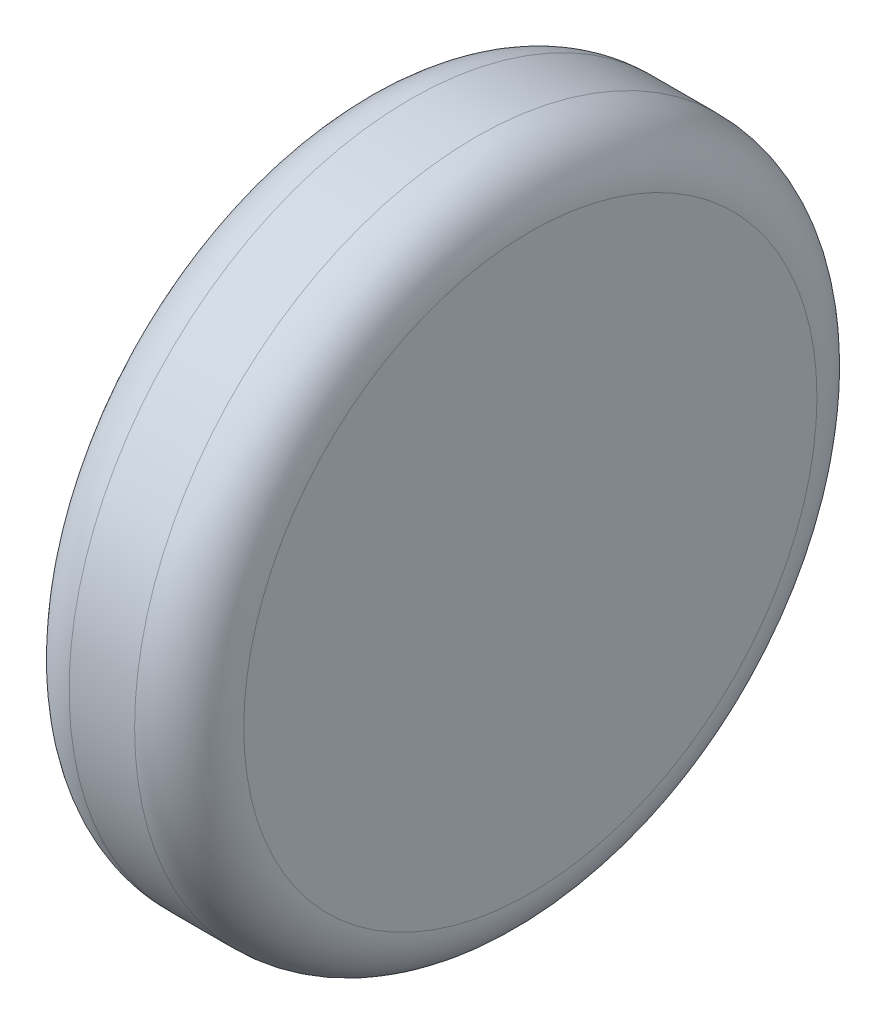
ISO-10303-21;
HEADER;
FILE_DESCRIPTION(('STEP AP214'),'2;1');
FILE_NAME('part.step','',(''),(''),'','','');
FILE_SCHEMA(('AUTOMOTIVE_DESIGN { 1 0 10303 214 1 1 1 1 }'));
ENDSEC;
DATA;
#1=APPLICATION_CONTEXT('core data for automotive mechanical design processes');
#2=APPLICATION_PROTOCOL_DEFINITION('international standard','automotive_design',2000,#1);
#3=PRODUCT_CONTEXT('',#1,'mechanical');
#4=PRODUCT('Part','Part','',(#3));
#5=PRODUCT_RELATED_PRODUCT_CATEGORY('part','',(#4));
#6=PRODUCT_DEFINITION_FORMATION('','',#4);
#7=PRODUCT_DEFINITION_CONTEXT('part definition',#1,'design');
#8=PRODUCT_DEFINITION('design','',#6,#7);
#9=PRODUCT_DEFINITION_SHAPE('','',#8);
#10=(LENGTH_UNIT() NAMED_UNIT(*) SI_UNIT(.MILLI.,.METRE.));
#11=(NAMED_UNIT(*) PLANE_ANGLE_UNIT() SI_UNIT($,.RADIAN.));
#12=(NAMED_UNIT(*) SI_UNIT($,.STERADIAN.) SOLID_ANGLE_UNIT());
#13=UNCERTAINTY_MEASURE_WITH_UNIT(LENGTH_MEASURE(1.E-05),#10,'distance_accuracy_value','');
#14=(GEOMETRIC_REPRESENTATION_CONTEXT(3) GLOBAL_UNCERTAINTY_ASSIGNED_CONTEXT((#13)) GLOBAL_UNIT_ASSIGNED_CONTEXT((#10,
#11,#12)) REPRESENTATION_CONTEXT('',''));
#15=CARTESIAN_POINT('',(0.,0.,0.));
#16=DIRECTION('',(0.,0.,1.));
#17=DIRECTION('',(1.,0.,0.));
#18=AXIS2_PLACEMENT_3D('',#15,#16,#17);
#19=CARTESIAN_POINT('',(-0.390364285309383,-0.332340218761648,0.1012));
#20=DIRECTION('',(1.,0.,0.));
#21=DIRECTION('',(0.,1.,0.));
#22=AXIS2_PLACEMENT_3D('',#19,#20,#21);
#23=PLANE('',#22);
#24=CARTESIAN_POINT('',(-0.390364285309383,-0.332340218761648,0.1012));
#25=DIRECTION('',(1.,0.,0.));
#26=DIRECTION('',(0.,0.,-1.));
#27=AXIS2_PLACEMENT_3D('',#24,#25,#26);
#28=CIRCLE('',#27,0.0262499999999999);
#29=CARTESIAN_POINT('',(-0.390364285309383,-0.332340218761648,0.0749500000000001));
#30=VERTEX_POINT('',#29);
#31=CARTESIAN_POINT('',(-0.390364285309383,-0.306090218761648,0.1012));
#32=VERTEX_POINT('',#31);
#33=EDGE_CURVE('E55',#30,#32,#28,.T.);
#34=ORIENTED_EDGE('',*,*,#33,.F.);
#35=CARTESIAN_POINT('',(-0.390364285309383,-0.332340218761648,0.1012));
#36=DIRECTION('',(1.,0.,0.));
#37=DIRECTION('',(0.,0.,1.));
#38=AXIS2_PLACEMENT_3D('',#35,#36,#37);
#39=CIRCLE('',#38,0.02625);
#40=CARTESIAN_POINT('',(-0.390364285309383,-0.332340218761648,0.12745));
#41=VERTEX_POINT('',#40);
#42=EDGE_CURVE('E49',#41,#30,#39,.T.);
#43=ORIENTED_EDGE('',*,*,#42,.F.);
#44=CARTESIAN_POINT('',(-0.390364285309383,-0.332340218761648,0.1012));
#45=DIRECTION('',(1.,0.,0.));
#46=DIRECTION('',(0.,1.,0.));
#47=AXIS2_PLACEMENT_3D('',#44,#45,#46);
#48=CIRCLE('',#47,0.02625);
#49=EDGE_CURVE('E53',#32,#41,#48,.T.);
#50=ORIENTED_EDGE('',*,*,#49,.F.);
#51=EDGE_LOOP('',(#34,#43,#50));
#52=FACE_BOUND('',#51,.T.);
#53=ADVANCED_FACE('F17',(#52),#23,.F.);
#54=CARTESIAN_POINT('',(-0.385364285309383,-0.332340218761648,0.1012));
#55=DIRECTION('',(1.,0.,0.));
#56=DIRECTION('',(0.,0.,1.));
#57=AXIS2_PLACEMENT_3D('',#54,#55,#56);
#58=TOROIDAL_SURFACE('',#57,0.02625,0.005);
#59=CARTESIAN_POINT('',(-0.385364285309383,-0.332340218761648,0.1012));
#60=DIRECTION('',(1.,0.,0.));
#61=DIRECTION('',(0.,1.,0.));
#62=AXIS2_PLACEMENT_3D('',#59,#60,#61);
#63=CIRCLE('',#62,0.03125);
#64=CARTESIAN_POINT('',(-0.385364285309383,-0.301090218761648,0.1012));
#65=VERTEX_POINT('',#64);
#66=EDGE_CURVE('E62',#65,#65,#63,.T.);
#67=ORIENTED_EDGE('',*,*,#66,.F.);
#68=EDGE_LOOP('',(#67));
#69=FACE_BOUND('',#68,.T.);
#70=ORIENTED_EDGE('',*,*,#33,.T.);
#71=ORIENTED_EDGE('',*,*,#49,.T.);
#72=ORIENTED_EDGE('',*,*,#42,.T.);
#73=EDGE_LOOP('',(#70,#71,#72));
#74=FACE_BOUND('',#73,.T.);
#75=ADVANCED_FACE('F60',(#69,#74),#58,.T.);
#76=CARTESIAN_POINT('',(-0.374364285309383,-0.332340218761648,0.1012));
#77=DIRECTION('',(1.,0.,0.));
#78=DIRECTION('',(0.,1.,0.));
#79=AXIS2_PLACEMENT_3D('',#76,#77,#78);
#80=CYLINDRICAL_SURFACE('',#79,0.03125);
#81=CARTESIAN_POINT('',(-0.379364285309383,-0.332340218761648,0.1012));
#82=DIRECTION('',(1.,0.,0.));
#83=DIRECTION('',(0.,0.,1.));
#84=AXIS2_PLACEMENT_3D('',#81,#82,#83);
#85=CIRCLE('',#84,0.03125);
#86=CARTESIAN_POINT('',(-0.379364285309383,-0.332340218761648,0.13245));
#87=VERTEX_POINT('',#86);
#88=EDGE_CURVE('E86',#87,#87,#85,.T.);
#89=ORIENTED_EDGE('',*,*,#88,.F.);
#90=EDGE_LOOP('',(#89));
#91=FACE_BOUND('',#90,.T.);
#92=ORIENTED_EDGE('',*,*,#66,.T.);
#93=EDGE_LOOP('',(#92));
#94=FACE_BOUND('',#93,.T.);
#95=ADVANCED_FACE('F79',(#91,#94),#80,.T.);
#96=CARTESIAN_POINT('',(-0.379364285309383,-0.332340218761648,0.1012));
#97=DIRECTION('',(1.,0.,0.));
#98=DIRECTION('',(0.,0.,1.));
#99=AXIS2_PLACEMENT_3D('',#96,#97,#98);
#100=TOROIDAL_SURFACE('',#99,0.02625,0.005);
#101=ORIENTED_EDGE('',*,*,#88,.T.);
#102=EDGE_LOOP('',(#101));
#103=FACE_BOUND('',#102,.T.);
#104=CARTESIAN_POINT('',(-0.374364285309383,-0.332340218761648,0.1012));
#105=DIRECTION('',(-1.,0.,0.));
#106=DIRECTION('',(0.,0.,-1.));
#107=AXIS2_PLACEMENT_3D('',#104,#105,#106);
#108=CIRCLE('',#107,0.0262499999999999);
#109=CARTESIAN_POINT('',(-0.374364285309383,-0.332340218761648,0.12745));
#110=VERTEX_POINT('',#109);
#111=CARTESIAN_POINT('',(-0.374364285309383,-0.332340218761648,0.0749500000000001));
#112=VERTEX_POINT('',#111);
#113=EDGE_CURVE('E11',#110,#112,#108,.F.);
#114=ORIENTED_EDGE('',*,*,#113,.F.);
#115=CARTESIAN_POINT('',(-0.374364285309383,-0.332340218761648,0.1012));
#116=DIRECTION('',(-1.,0.,0.));
#117=DIRECTION('',(0.,0.,1.));
#118=AXIS2_PLACEMENT_3D('',#115,#116,#117);
#119=CIRCLE('',#118,0.02625);
#120=CARTESIAN_POINT('',(-0.374364285309383,-0.306090218761648,0.1012));
#121=VERTEX_POINT('',#120);
#122=EDGE_CURVE('E28',#121,#110,#119,.F.);
#123=ORIENTED_EDGE('',*,*,#122,.F.);
#124=CARTESIAN_POINT('',(-0.374364285309383,-0.332340218761648,0.1012));
#125=DIRECTION('',(-1.,0.,0.));
#126=DIRECTION('',(0.,1.,0.));
#127=AXIS2_PLACEMENT_3D('',#124,#125,#126);
#128=CIRCLE('',#127,0.02625);
#129=EDGE_CURVE('E92',#112,#121,#128,.F.);
#130=ORIENTED_EDGE('',*,*,#129,.F.);
#131=EDGE_LOOP('',(#114,#123,#130));
#132=FACE_BOUND('',#131,.T.);
#133=ADVANCED_FACE('F117',(#103,#132),#100,.T.);
#134=CARTESIAN_POINT('',(-0.374364285309383,-0.332340218761648,0.1012));
#135=DIRECTION('',(1.,0.,0.));
#136=DIRECTION('',(0.,1.,0.));
#137=AXIS2_PLACEMENT_3D('',#134,#135,#136);
#138=PLANE('',#137);
#139=ORIENTED_EDGE('',*,*,#122,.T.);
#140=ORIENTED_EDGE('',*,*,#113,.T.);
#141=ORIENTED_EDGE('',*,*,#129,.T.);
#142=EDGE_LOOP('',(#139,#140,#141));
#143=FACE_BOUND('',#142,.T.);
#144=ADVANCED_FACE('F99',(#143),#138,.T.);
#145=CLOSED_SHELL('',(#53,#75,#95,#133,#144));
#146=MANIFOLD_SOLID_BREP('B1',#145);
#147=ADVANCED_BREP_SHAPE_REPRESENTATION('',(#18,#146),#14);
#148=SHAPE_DEFINITION_REPRESENTATION(#9,#147);
ENDSEC;
END-ISO-10303-21;
